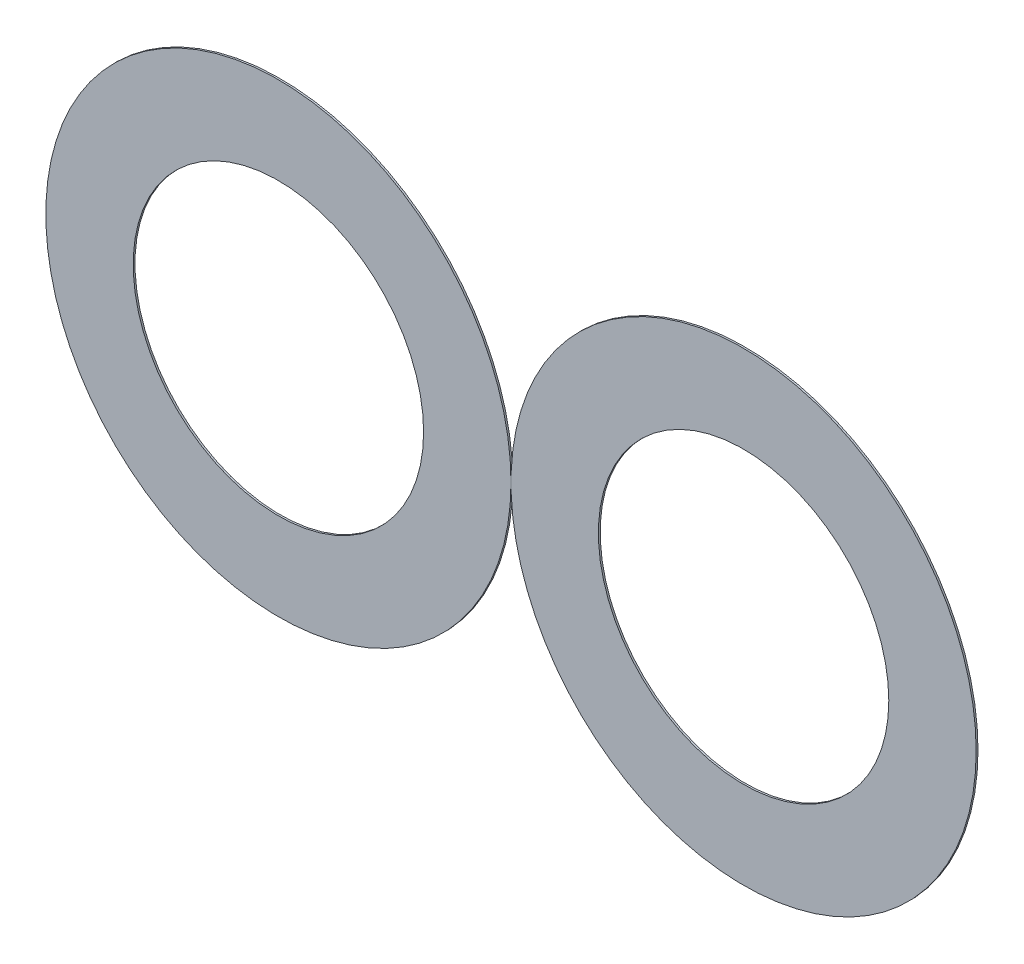
ISO-10303-21;
HEADER;
FILE_DESCRIPTION(('STEP AP214'),'2;1');
FILE_NAME('part.step','',(''),(''),'','','');
FILE_SCHEMA(('AUTOMOTIVE_DESIGN { 1 0 10303 214 1 1 1 1 }'));
ENDSEC;
DATA;
#1=APPLICATION_CONTEXT('core data for automotive mechanical design processes');
#2=APPLICATION_PROTOCOL_DEFINITION('international standard','automotive_design',2000,#1);
#3=PRODUCT_CONTEXT('',#1,'mechanical');
#4=PRODUCT('Part','Part','',(#3));
#5=PRODUCT_RELATED_PRODUCT_CATEGORY('part','',(#4));
#6=PRODUCT_DEFINITION_FORMATION('','',#4);
#7=PRODUCT_DEFINITION_CONTEXT('part definition',#1,'design');
#8=PRODUCT_DEFINITION('design','',#6,#7);
#9=PRODUCT_DEFINITION_SHAPE('','',#8);
#10=(LENGTH_UNIT() NAMED_UNIT(*) SI_UNIT(.MILLI.,.METRE.));
#11=(NAMED_UNIT(*) PLANE_ANGLE_UNIT() SI_UNIT($,.RADIAN.));
#12=(NAMED_UNIT(*) SI_UNIT($,.STERADIAN.) SOLID_ANGLE_UNIT());
#13=UNCERTAINTY_MEASURE_WITH_UNIT(LENGTH_MEASURE(1.E-05),#10,'distance_accuracy_value','');
#14=(GEOMETRIC_REPRESENTATION_CONTEXT(3) GLOBAL_UNCERTAINTY_ASSIGNED_CONTEXT((#13)) GLOBAL_UNIT_ASSIGNED_CONTEXT((#10,
#11,#12)) REPRESENTATION_CONTEXT('',''));
#15=CARTESIAN_POINT('',(0.,0.,0.));
#16=DIRECTION('',(0.,0.,1.));
#17=DIRECTION('',(1.,0.,0.));
#18=AXIS2_PLACEMENT_3D('',#15,#16,#17);
#19=CARTESIAN_POINT('',(40.4739793651432,16.6,0.1));
#20=DIRECTION('',(0.,0.,-1.));
#21=DIRECTION('',(-1.,0.,0.));
#22=AXIS2_PLACEMENT_3D('',#19,#20,#21);
#23=CYLINDRICAL_SURFACE('',#22,8.00779472319925);
#24=CARTESIAN_POINT('',(40.4739793651432,16.6,0.1));
#25=DIRECTION('',(0.,0.,1.));
#26=DIRECTION('',(1.,0.,0.));
#27=AXIS2_PLACEMENT_3D('',#24,#25,#26);
#28=CIRCLE('',#27,8.00779472319925);
#29=CARTESIAN_POINT('',(48.4817740883425,16.6,0.1));
#30=VERTEX_POINT('',#29);
#31=EDGE_CURVE('E51',#30,#30,#28,.T.);
#32=ORIENTED_EDGE('',*,*,#31,.T.);
#33=EDGE_LOOP('',(#32));
#34=FACE_BOUND('',#33,.T.);
#35=CARTESIAN_POINT('',(40.4739793651432,16.6,0.));
#36=DIRECTION('',(0.,0.,1.));
#37=DIRECTION('',(1.,0.,0.));
#38=AXIS2_PLACEMENT_3D('',#35,#36,#37);
#39=CIRCLE('',#38,8.00779472319925);
#40=CARTESIAN_POINT('',(48.4817740883425,16.6,0.));
#41=VERTEX_POINT('',#40);
#42=EDGE_CURVE('E57',#41,#41,#39,.T.);
#43=ORIENTED_EDGE('',*,*,#42,.F.);
#44=EDGE_LOOP('',(#43));
#45=FACE_BOUND('',#44,.T.);
#46=ADVANCED_FACE('F44',(#34,#45),#23,.F.);
#47=CARTESIAN_POINT('',(40.4739793651432,16.6,0.1));
#48=DIRECTION('',(0.,0.,-1.));
#49=DIRECTION('',(-1.,0.,0.));
#50=AXIS2_PLACEMENT_3D('',#47,#48,#49);
#51=CYLINDRICAL_SURFACE('',#50,12.8266666666666);
#52=CARTESIAN_POINT('',(40.4739793651432,16.6,0.1));
#53=DIRECTION('',(0.,0.,1.));
#54=DIRECTION('',(1.,0.,0.));
#55=AXIS2_PLACEMENT_3D('',#52,#53,#54);
#56=CIRCLE('',#55,12.8266666666666);
#57=CARTESIAN_POINT('',(53.3006460318098,16.6,0.1));
#58=VERTEX_POINT('',#57);
#59=EDGE_CURVE('E12',#58,#58,#56,.T.);
#60=ORIENTED_EDGE('',*,*,#59,.F.);
#61=EDGE_LOOP('',(#60));
#62=FACE_BOUND('',#61,.T.);
#63=CARTESIAN_POINT('',(40.4739793651432,16.6,0.));
#64=DIRECTION('',(0.,0.,1.));
#65=DIRECTION('',(1.,0.,0.));
#66=AXIS2_PLACEMENT_3D('',#63,#64,#65);
#67=CIRCLE('',#66,12.8266666666666);
#68=CARTESIAN_POINT('',(53.3006460318098,16.6,0.));
#69=VERTEX_POINT('',#68);
#70=EDGE_CURVE('E47',#69,#69,#67,.T.);
#71=ORIENTED_EDGE('',*,*,#70,.T.);
#72=EDGE_LOOP('',(#71));
#73=FACE_BOUND('',#72,.T.);
#74=ADVANCED_FACE('F64',(#62,#73),#51,.T.);
#75=CARTESIAN_POINT('',(0.,0.,0.1));
#76=DIRECTION('',(0.,0.,1.));
#77=DIRECTION('',(1.,0.,0.));
#78=AXIS2_PLACEMENT_3D('',#75,#76,#77);
#79=PLANE('',#78);
#80=ORIENTED_EDGE('',*,*,#31,.F.);
#81=EDGE_LOOP('',(#80));
#82=FACE_BOUND('',#81,.T.);
#83=ORIENTED_EDGE('',*,*,#59,.T.);
#84=EDGE_LOOP('',(#83));
#85=FACE_BOUND('',#84,.T.);
#86=ADVANCED_FACE('F68',(#82,#85),#79,.T.);
#87=CARTESIAN_POINT('',(0.,0.,0.));
#88=DIRECTION('',(0.,0.,1.));
#89=DIRECTION('',(1.,0.,0.));
#90=AXIS2_PLACEMENT_3D('',#87,#88,#89);
#91=PLANE('',#90);
#92=ORIENTED_EDGE('',*,*,#42,.T.);
#93=EDGE_LOOP('',(#92));
#94=FACE_BOUND('',#93,.T.);
#95=ORIENTED_EDGE('',*,*,#70,.F.);
#96=EDGE_LOOP('',(#95));
#97=FACE_BOUND('',#96,.T.);
#98=ADVANCED_FACE('F66',(#94,#97),#91,.F.);
#99=CLOSED_SHELL('',(#46,#74,#86,#98));
#100=MANIFOLD_SOLID_BREP('B2',#99);
#101=CARTESIAN_POINT('',(14.8206460318098,16.6,0.1));
#102=DIRECTION('',(0.,0.,-1.));
#103=DIRECTION('',(-1.,0.,0.));
#104=AXIS2_PLACEMENT_3D('',#101,#102,#103);
#105=CYLINDRICAL_SURFACE('',#104,8.00779472319925);
#106=CARTESIAN_POINT('',(14.8206460318098,16.6,0.1));
#107=DIRECTION('',(0.,0.,1.));
#108=DIRECTION('',(1.,0.,0.));
#109=AXIS2_PLACEMENT_3D('',#106,#107,#108);
#110=CIRCLE('',#109,8.00779472319925);
#111=CARTESIAN_POINT('',(22.8284407550091,16.6,0.1));
#112=VERTEX_POINT('',#111);
#113=EDGE_CURVE('E112',#112,#112,#110,.T.);
#114=ORIENTED_EDGE('',*,*,#113,.T.);
#115=EDGE_LOOP('',(#114));
#116=FACE_BOUND('',#115,.T.);
#117=CARTESIAN_POINT('',(14.8206460318098,16.6,0.));
#118=DIRECTION('',(0.,0.,1.));
#119=DIRECTION('',(1.,0.,0.));
#120=AXIS2_PLACEMENT_3D('',#117,#118,#119);
#121=CIRCLE('',#120,8.00779472319925);
#122=CARTESIAN_POINT('',(22.8284407550091,16.6,0.));
#123=VERTEX_POINT('',#122);
#124=EDGE_CURVE('E118',#123,#123,#121,.T.);
#125=ORIENTED_EDGE('',*,*,#124,.F.);
#126=EDGE_LOOP('',(#125));
#127=FACE_BOUND('',#126,.T.);
#128=ADVANCED_FACE('F105',(#116,#127),#105,.F.);
#129=CARTESIAN_POINT('',(14.8206460318098,16.6,0.1));
#130=DIRECTION('',(0.,0.,-1.));
#131=DIRECTION('',(-1.,0.,0.));
#132=AXIS2_PLACEMENT_3D('',#129,#130,#131);
#133=CYLINDRICAL_SURFACE('',#132,12.8266666666667);
#134=CARTESIAN_POINT('',(14.8206460318098,16.6,0.1));
#135=DIRECTION('',(0.,0.,1.));
#136=DIRECTION('',(1.,0.,0.));
#137=AXIS2_PLACEMENT_3D('',#134,#135,#136);
#138=CIRCLE('',#137,12.8266666666667);
#139=CARTESIAN_POINT('',(27.6473126984765,16.6,0.1));
#140=VERTEX_POINT('',#139);
#141=EDGE_CURVE('E43',#140,#140,#138,.T.);
#142=ORIENTED_EDGE('',*,*,#141,.F.);
#143=EDGE_LOOP('',(#142));
#144=FACE_BOUND('',#143,.T.);
#145=CARTESIAN_POINT('',(14.8206460318098,16.6,0.));
#146=DIRECTION('',(0.,0.,1.));
#147=DIRECTION('',(1.,0.,0.));
#148=AXIS2_PLACEMENT_3D('',#145,#146,#147);
#149=CIRCLE('',#148,12.8266666666667);
#150=CARTESIAN_POINT('',(27.6473126984765,16.6,0.));
#151=VERTEX_POINT('',#150);
#152=EDGE_CURVE('E108',#151,#151,#149,.T.);
#153=ORIENTED_EDGE('',*,*,#152,.T.);
#154=EDGE_LOOP('',(#153));
#155=FACE_BOUND('',#154,.T.);
#156=ADVANCED_FACE('F125',(#144,#155),#133,.T.);
#157=CARTESIAN_POINT('',(0.,0.,0.1));
#158=DIRECTION('',(0.,0.,1.));
#159=DIRECTION('',(1.,0.,0.));
#160=AXIS2_PLACEMENT_3D('',#157,#158,#159);
#161=PLANE('',#160);
#162=ORIENTED_EDGE('',*,*,#113,.F.);
#163=EDGE_LOOP('',(#162));
#164=FACE_BOUND('',#163,.T.);
#165=ORIENTED_EDGE('',*,*,#141,.T.);
#166=EDGE_LOOP('',(#165));
#167=FACE_BOUND('',#166,.T.);
#168=ADVANCED_FACE('F129',(#164,#167),#161,.T.);
#169=CARTESIAN_POINT('',(0.,0.,0.));
#170=DIRECTION('',(0.,0.,1.));
#171=DIRECTION('',(1.,0.,0.));
#172=AXIS2_PLACEMENT_3D('',#169,#170,#171);
#173=PLANE('',#172);
#174=ORIENTED_EDGE('',*,*,#124,.T.);
#175=EDGE_LOOP('',(#174));
#176=FACE_BOUND('',#175,.T.);
#177=ORIENTED_EDGE('',*,*,#152,.F.);
#178=EDGE_LOOP('',(#177));
#179=FACE_BOUND('',#178,.T.);
#180=ADVANCED_FACE('F127',(#176,#179),#173,.F.);
#181=CLOSED_SHELL('',(#128,#156,#168,#180));
#182=MANIFOLD_SOLID_BREP('B7',#181);
#183=ADVANCED_BREP_SHAPE_REPRESENTATION('',(#18,#100,#182),#14);
#184=SHAPE_DEFINITION_REPRESENTATION(#9,#183);
ENDSEC;
END-ISO-10303-21;
